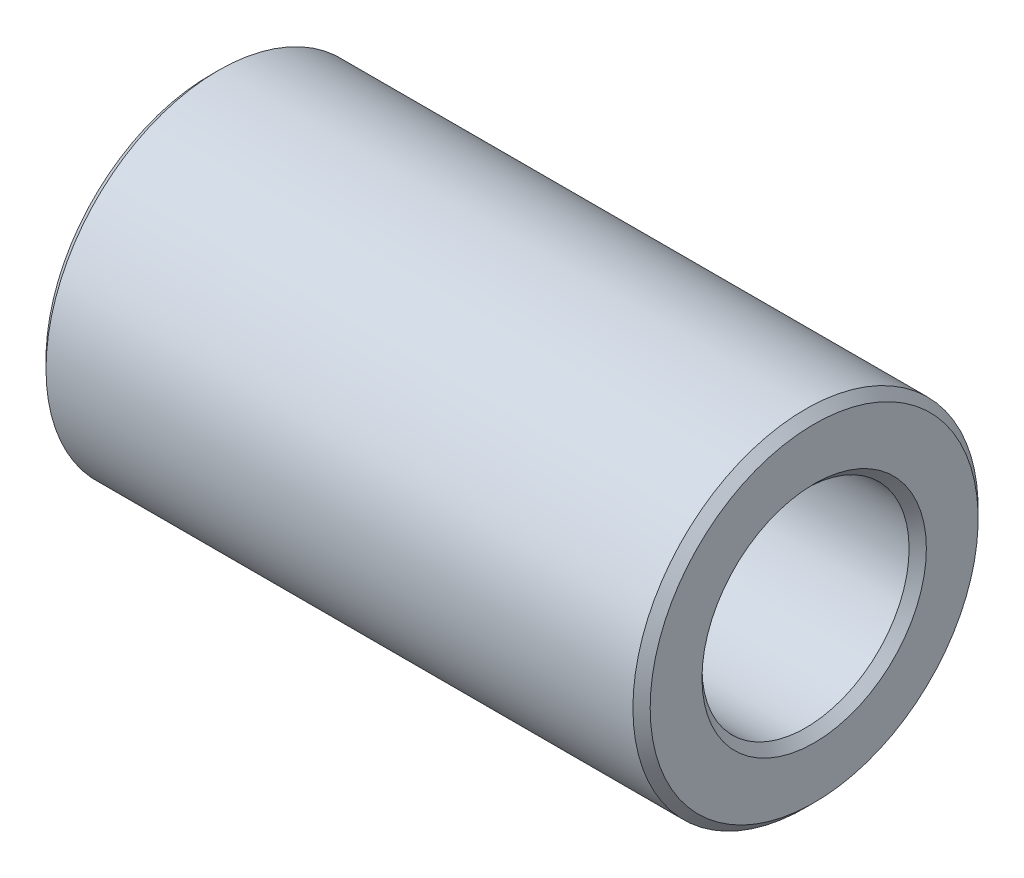
ISO-10303-21;
HEADER;
FILE_DESCRIPTION(('STEP AP214'),'2;1');
FILE_NAME('part.step','',(''),(''),'','','');
FILE_SCHEMA(('AUTOMOTIVE_DESIGN { 1 0 10303 214 1 1 1 1 }'));
ENDSEC;
DATA;
#1=APPLICATION_CONTEXT('core data for automotive mechanical design processes');
#2=APPLICATION_PROTOCOL_DEFINITION('international standard','automotive_design',2000,#1);
#3=PRODUCT_CONTEXT('',#1,'mechanical');
#4=PRODUCT('Part','Part','',(#3));
#5=PRODUCT_RELATED_PRODUCT_CATEGORY('part','',(#4));
#6=PRODUCT_DEFINITION_FORMATION('','',#4);
#7=PRODUCT_DEFINITION_CONTEXT('part definition',#1,'design');
#8=PRODUCT_DEFINITION('design','',#6,#7);
#9=PRODUCT_DEFINITION_SHAPE('','',#8);
#10=(LENGTH_UNIT() NAMED_UNIT(*) SI_UNIT(.MILLI.,.METRE.));
#11=(NAMED_UNIT(*) PLANE_ANGLE_UNIT() SI_UNIT($,.RADIAN.));
#12=(NAMED_UNIT(*) SI_UNIT($,.STERADIAN.) SOLID_ANGLE_UNIT());
#13=UNCERTAINTY_MEASURE_WITH_UNIT(LENGTH_MEASURE(1.E-05),#10,'distance_accuracy_value','');
#14=(GEOMETRIC_REPRESENTATION_CONTEXT(3) GLOBAL_UNCERTAINTY_ASSIGNED_CONTEXT((#13)) GLOBAL_UNIT_ASSIGNED_CONTEXT((#10,
#11,#12)) REPRESENTATION_CONTEXT('',''));
#15=CARTESIAN_POINT('',(0.,0.,0.));
#16=DIRECTION('',(0.,0.,1.));
#17=DIRECTION('',(1.,0.,0.));
#18=AXIS2_PLACEMENT_3D('',#15,#16,#17);
#19=CARTESIAN_POINT('',(0.,6.,0.));
#20=DIRECTION('',(1.,0.,0.));
#21=DIRECTION('',(0.,0.,-1.));
#22=AXIS2_PLACEMENT_3D('',#19,#20,#21);
#23=PLANE('',#22);
#24=CARTESIAN_POINT('',(0.,0.,0.));
#25=DIRECTION('',(1.,0.,0.));
#26=DIRECTION('',(0.,0.,-1.));
#27=AXIS2_PLACEMENT_3D('',#24,#25,#26);
#28=CIRCLE('',#27,6.49999999999994);
#29=CARTESIAN_POINT('',(0.,0.,-6.49999999999994));
#30=VERTEX_POINT('',#29);
#31=EDGE_CURVE('E10',#30,#30,#28,.T.);
#32=ORIENTED_EDGE('',*,*,#31,.T.);
#33=EDGE_LOOP('',(#32));
#34=FACE_BOUND('',#33,.T.);
#35=CARTESIAN_POINT('',(0.,0.,0.));
#36=DIRECTION('',(1.,0.,0.));
#37=DIRECTION('',(0.,0.,-1.));
#38=AXIS2_PLACEMENT_3D('',#35,#36,#37);
#39=CIRCLE('',#38,9.5);
#40=CARTESIAN_POINT('',(0.,0.,-9.5));
#41=VERTEX_POINT('',#40);
#42=EDGE_CURVE('E39',#41,#41,#39,.F.);
#43=ORIENTED_EDGE('',*,*,#42,.T.);
#44=EDGE_LOOP('',(#43));
#45=FACE_BOUND('',#44,.T.);
#46=ADVANCED_FACE('F32',(#34,#45),#23,.F.);
#47=CARTESIAN_POINT('',(-1000.,0.,0.));
#48=DIRECTION('',(-1.,0.,0.));
#49=DIRECTION('',(0.,0.,1.));
#50=AXIS2_PLACEMENT_3D('',#47,#48,#49);
#51=CYLINDRICAL_SURFACE('',#50,10.);
#52=CARTESIAN_POINT('',(34.4999999999998,0.,0.));
#53=DIRECTION('',(-1.,0.,0.));
#54=DIRECTION('',(0.,0.,1.));
#55=AXIS2_PLACEMENT_3D('',#52,#53,#54);
#56=CIRCLE('',#55,10.);
#57=CARTESIAN_POINT('',(34.4999999999998,0.,10.));
#58=VERTEX_POINT('',#57);
#59=EDGE_CURVE('E58',#58,#58,#56,.T.);
#60=ORIENTED_EDGE('',*,*,#59,.T.);
#61=EDGE_LOOP('',(#60));
#62=FACE_BOUND('',#61,.T.);
#63=CARTESIAN_POINT('',(0.499999999999945,0.,0.));
#64=DIRECTION('',(1.,0.,0.));
#65=DIRECTION('',(0.,0.,-1.));
#66=AXIS2_PLACEMENT_3D('',#63,#64,#65);
#67=CIRCLE('',#66,10.);
#68=CARTESIAN_POINT('',(0.499999999999945,0.,-10.));
#69=VERTEX_POINT('',#68);
#70=EDGE_CURVE('E61',#69,#69,#67,.T.);
#71=ORIENTED_EDGE('',*,*,#70,.T.);
#72=EDGE_LOOP('',(#71));
#73=FACE_BOUND('',#72,.T.);
#74=ADVANCED_FACE('F65',(#62,#73),#51,.T.);
#75=CARTESIAN_POINT('',(35.,6.,0.));
#76=DIRECTION('',(-1.,0.,0.));
#77=DIRECTION('',(0.,0.,1.));
#78=AXIS2_PLACEMENT_3D('',#75,#76,#77);
#79=PLANE('',#78);
#80=CARTESIAN_POINT('',(35.,0.,0.));
#81=DIRECTION('',(-1.,0.,0.));
#82=DIRECTION('',(0.,0.,1.));
#83=AXIS2_PLACEMENT_3D('',#80,#81,#82);
#84=CIRCLE('',#83,9.49999999999977);
#85=CARTESIAN_POINT('',(35.,0.,9.49999999999977));
#86=VERTEX_POINT('',#85);
#87=EDGE_CURVE('E52',#86,#86,#84,.F.);
#88=ORIENTED_EDGE('',*,*,#87,.T.);
#89=EDGE_LOOP('',(#88));
#90=FACE_BOUND('',#89,.T.);
#91=CARTESIAN_POINT('',(35.,0.,0.));
#92=DIRECTION('',(-1.,0.,0.));
#93=DIRECTION('',(0.,0.,1.));
#94=AXIS2_PLACEMENT_3D('',#91,#92,#93);
#95=CIRCLE('',#94,6.50000000000013);
#96=CARTESIAN_POINT('',(35.,0.,6.50000000000013));
#97=VERTEX_POINT('',#96);
#98=EDGE_CURVE('E55',#97,#97,#95,.T.);
#99=ORIENTED_EDGE('',*,*,#98,.T.);
#100=EDGE_LOOP('',(#99));
#101=FACE_BOUND('',#100,.T.);
#102=ADVANCED_FACE('F80',(#90,#101),#79,.F.);
#103=CARTESIAN_POINT('',(-1000.,0.,0.));
#104=DIRECTION('',(-1.,0.,0.));
#105=DIRECTION('',(0.,0.,1.));
#106=AXIS2_PLACEMENT_3D('',#103,#104,#105);
#107=CYLINDRICAL_SURFACE('',#106,6.);
#108=CARTESIAN_POINT('',(34.5,0.,0.));
#109=DIRECTION('',(-1.,0.,0.));
#110=DIRECTION('',(0.,0.,1.));
#111=AXIS2_PLACEMENT_3D('',#108,#109,#110);
#112=CIRCLE('',#111,6.);
#113=CARTESIAN_POINT('',(34.5,0.,6.));
#114=VERTEX_POINT('',#113);
#115=EDGE_CURVE('E43',#114,#114,#112,.F.);
#116=ORIENTED_EDGE('',*,*,#115,.T.);
#117=EDGE_LOOP('',(#116));
#118=FACE_BOUND('',#117,.T.);
#119=CARTESIAN_POINT('',(0.499999999999945,0.,0.));
#120=DIRECTION('',(1.,0.,0.));
#121=DIRECTION('',(0.,0.,-1.));
#122=AXIS2_PLACEMENT_3D('',#119,#120,#121);
#123=CIRCLE('',#122,6.);
#124=CARTESIAN_POINT('',(0.499999999999945,0.,-6.));
#125=VERTEX_POINT('',#124);
#126=EDGE_CURVE('E47',#125,#125,#123,.F.);
#127=ORIENTED_EDGE('',*,*,#126,.T.);
#128=EDGE_LOOP('',(#127));
#129=FACE_BOUND('',#128,.T.);
#130=ADVANCED_FACE('F88',(#118,#129),#107,.F.);
#131=CARTESIAN_POINT('',(34.4999999999998,0.,0.));
#132=DIRECTION('',(-1.,0.,0.));
#133=DIRECTION('',(0.,0.,1.));
#134=AXIS2_PLACEMENT_3D('',#131,#132,#133);
#135=CONICAL_SURFACE('',#134,10.,0.785398163397426);
#136=ORIENTED_EDGE('',*,*,#87,.F.);
#137=EDGE_LOOP('',(#136));
#138=FACE_BOUND('',#137,.T.);
#139=ORIENTED_EDGE('',*,*,#59,.F.);
#140=EDGE_LOOP('',(#139));
#141=FACE_BOUND('',#140,.T.);
#142=ADVANCED_FACE('F85',(#138,#141),#135,.T.);
#143=CARTESIAN_POINT('',(34.9999999999999,0.,0.));
#144=DIRECTION('',(1.,0.,0.));
#145=DIRECTION('',(0.,0.,-1.));
#146=AXIS2_PLACEMENT_3D('',#143,#144,#145);
#147=CONICAL_SURFACE('',#146,6.50000000000005,0.78539816339755);
#148=ORIENTED_EDGE('',*,*,#115,.F.);
#149=EDGE_LOOP('',(#148));
#150=FACE_BOUND('',#149,.T.);
#151=ORIENTED_EDGE('',*,*,#98,.F.);
#152=EDGE_LOOP('',(#151));
#153=FACE_BOUND('',#152,.T.);
#154=ADVANCED_FACE('F73',(#150,#153),#147,.F.);
#155=CARTESIAN_POINT('',(0.499999999999945,0.,0.));
#156=DIRECTION('',(-1.,0.,0.));
#157=DIRECTION('',(0.,0.,1.));
#158=AXIS2_PLACEMENT_3D('',#155,#156,#157);
#159=CONICAL_SURFACE('',#158,6.,0.785398163397447);
#160=ORIENTED_EDGE('',*,*,#31,.F.);
#161=EDGE_LOOP('',(#160));
#162=FACE_BOUND('',#161,.T.);
#163=ORIENTED_EDGE('',*,*,#126,.F.);
#164=EDGE_LOOP('',(#163));
#165=FACE_BOUND('',#164,.T.);
#166=ADVANCED_FACE('F69',(#162,#165),#159,.F.);
#167=CARTESIAN_POINT('',(0.,0.,0.));
#168=DIRECTION('',(1.,0.,0.));
#169=DIRECTION('',(0.,0.,-1.));
#170=AXIS2_PLACEMENT_3D('',#167,#168,#169);
#171=CONICAL_SURFACE('',#170,9.5,0.785398163397502);
#172=ORIENTED_EDGE('',*,*,#70,.F.);
#173=EDGE_LOOP('',(#172));
#174=FACE_BOUND('',#173,.T.);
#175=ORIENTED_EDGE('',*,*,#42,.F.);
#176=EDGE_LOOP('',(#175));
#177=FACE_BOUND('',#176,.T.);
#178=ADVANCED_FACE('F34',(#174,#177),#171,.T.);
#179=CLOSED_SHELL('',(#46,#74,#102,#130,#142,#154,#166,#178));
#180=MANIFOLD_SOLID_BREP('B2',#179);
#181=ADVANCED_BREP_SHAPE_REPRESENTATION('',(#18,#180),#14);
#182=SHAPE_DEFINITION_REPRESENTATION(#9,#181);
ENDSEC;
END-ISO-10303-21;
